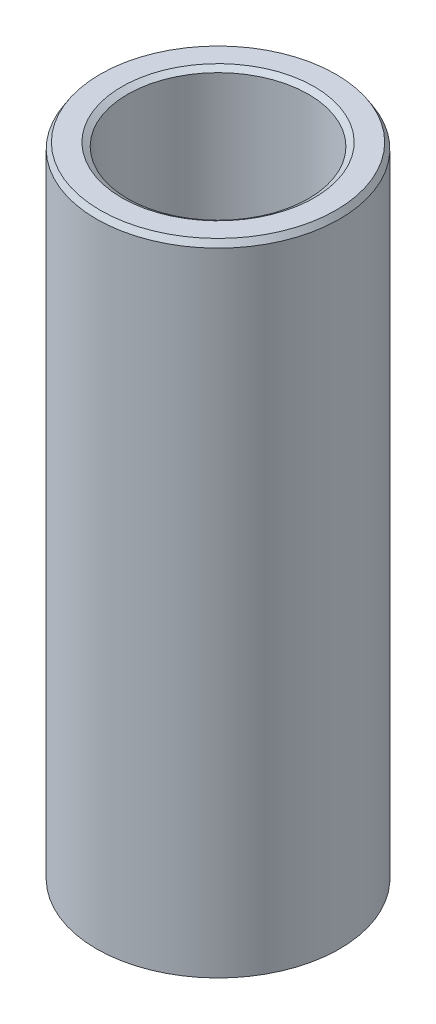
ISO-10303-21;
HEADER;
FILE_DESCRIPTION(('STEP AP214'),'2;1');
FILE_NAME('part.step','',(''),(''),'','','');
FILE_SCHEMA(('AUTOMOTIVE_DESIGN { 1 0 10303 214 1 1 1 1 }'));
ENDSEC;
DATA;
#1=APPLICATION_CONTEXT('core data for automotive mechanical design processes');
#2=APPLICATION_PROTOCOL_DEFINITION('international standard','automotive_design',2000,#1);
#3=PRODUCT_CONTEXT('',#1,'mechanical');
#4=PRODUCT('Part','Part','',(#3));
#5=PRODUCT_RELATED_PRODUCT_CATEGORY('part','',(#4));
#6=PRODUCT_DEFINITION_FORMATION('','',#4);
#7=PRODUCT_DEFINITION_CONTEXT('part definition',#1,'design');
#8=PRODUCT_DEFINITION('design','',#6,#7);
#9=PRODUCT_DEFINITION_SHAPE('','',#8);
#10=(LENGTH_UNIT() NAMED_UNIT(*) SI_UNIT(.MILLI.,.METRE.));
#11=(NAMED_UNIT(*) PLANE_ANGLE_UNIT() SI_UNIT($,.RADIAN.));
#12=(NAMED_UNIT(*) SI_UNIT($,.STERADIAN.) SOLID_ANGLE_UNIT());
#13=UNCERTAINTY_MEASURE_WITH_UNIT(LENGTH_MEASURE(1.E-05),#10,'distance_accuracy_value','');
#14=(GEOMETRIC_REPRESENTATION_CONTEXT(3) GLOBAL_UNCERTAINTY_ASSIGNED_CONTEXT((#13)) GLOBAL_UNIT_ASSIGNED_CONTEXT((#10,
#11,#12)) REPRESENTATION_CONTEXT('',''));
#15=CARTESIAN_POINT('',(0.,0.,0.));
#16=DIRECTION('',(0.,0.,1.));
#17=DIRECTION('',(1.,0.,0.));
#18=AXIS2_PLACEMENT_3D('',#15,#16,#17);
#19=CARTESIAN_POINT('',(0.,118.789899173376,0.));
#20=DIRECTION('',(0.,-1.,0.));
#21=DIRECTION('',(0.,0.,-1.));
#22=AXIS2_PLACEMENT_3D('',#19,#20,#21);
#23=CYLINDRICAL_SURFACE('',#22,22.5);
#24=CARTESIAN_POINT('',(0.,0.678954499826759,0.));
#25=DIRECTION('',(0.,1.,0.));
#26=DIRECTION('',(0.,0.,1.));
#27=AXIS2_PLACEMENT_3D('',#24,#25,#26);
#28=CIRCLE('',#27,22.5);
#29=CARTESIAN_POINT('',(0.,0.678954499826759,22.5));
#30=VERTEX_POINT('',#29);
#31=EDGE_CURVE('E10',#30,#30,#28,.T.);
#32=ORIENTED_EDGE('',*,*,#31,.T.);
#33=EDGE_LOOP('',(#32));
#34=FACE_BOUND('',#33,.T.);
#35=CARTESIAN_POINT('',(0.,117.709709744718,0.));
#36=DIRECTION('',(0.,1.,0.));
#37=DIRECTION('',(0.,0.,1.));
#38=AXIS2_PLACEMENT_3D('',#35,#36,#37);
#39=CIRCLE('',#38,22.5);
#40=CARTESIAN_POINT('',(0.,117.709709744718,22.5));
#41=VERTEX_POINT('',#40);
#42=EDGE_CURVE('E50',#41,#41,#39,.F.);
#43=ORIENTED_EDGE('',*,*,#42,.T.);
#44=EDGE_LOOP('',(#43));
#45=FACE_BOUND('',#44,.T.);
#46=ADVANCED_FACE('F39',(#34,#45),#23,.T.);
#47=CARTESIAN_POINT('',(0.,118.789899173376,0.));
#48=DIRECTION('',(0.,1.,0.));
#49=DIRECTION('',(0.,0.,1.));
#50=AXIS2_PLACEMENT_3D('',#47,#48,#49);
#51=PLANE('',#50);
#52=CARTESIAN_POINT('',(0.,118.789899173376,0.));
#53=DIRECTION('',(0.,1.,0.));
#54=DIRECTION('',(0.,0.,1.));
#55=AXIS2_PLACEMENT_3D('',#52,#53,#54);
#56=CIRCLE('',#55,17.8252690168274);
#57=CARTESIAN_POINT('',(0.,118.789899173376,17.8252690168274));
#58=VERTEX_POINT('',#57);
#59=EDGE_CURVE('E58',#58,#58,#56,.F.);
#60=ORIENTED_EDGE('',*,*,#59,.T.);
#61=EDGE_LOOP('',(#60));
#62=FACE_BOUND('',#61,.T.);
#63=CARTESIAN_POINT('',(0.,118.789899173376,0.));
#64=DIRECTION('',(0.,1.,0.));
#65=DIRECTION('',(0.,0.,1.));
#66=AXIS2_PLACEMENT_3D('',#63,#64,#65);
#67=CIRCLE('',#66,21.8210455001733);
#68=CARTESIAN_POINT('',(0.,118.789899173376,21.8210455001733));
#69=VERTEX_POINT('',#68);
#70=EDGE_CURVE('E61',#69,#69,#67,.T.);
#71=ORIENTED_EDGE('',*,*,#70,.T.);
#72=EDGE_LOOP('',(#71));
#73=FACE_BOUND('',#72,.T.);
#74=ADVANCED_FACE('F88',(#62,#73),#51,.T.);
#75=CARTESIAN_POINT('',(0.,0.,0.));
#76=DIRECTION('',(0.,1.,0.));
#77=DIRECTION('',(0.,0.,1.));
#78=AXIS2_PLACEMENT_3D('',#75,#76,#77);
#79=PLANE('',#78);
#80=CARTESIAN_POINT('',(0.,0.,0.));
#81=DIRECTION('',(0.,1.,0.));
#82=DIRECTION('',(0.,0.,1.));
#83=AXIS2_PLACEMENT_3D('',#80,#81,#82);
#84=CIRCLE('',#83,17.424034087997);
#85=CARTESIAN_POINT('',(0.,0.,17.424034087997));
#86=VERTEX_POINT('',#85);
#87=EDGE_CURVE('E51',#86,#86,#84,.T.);
#88=ORIENTED_EDGE('',*,*,#87,.T.);
#89=EDGE_LOOP('',(#88));
#90=FACE_BOUND('',#89,.T.);
#91=CARTESIAN_POINT('',(0.,0.,0.));
#92=DIRECTION('',(0.,1.,0.));
#93=DIRECTION('',(0.,0.,1.));
#94=AXIS2_PLACEMENT_3D('',#91,#92,#93);
#95=CIRCLE('',#94,21.4198105713428);
#96=CARTESIAN_POINT('',(0.,0.,21.4198105713428));
#97=VERTEX_POINT('',#96);
#98=EDGE_CURVE('E54',#97,#97,#95,.F.);
#99=ORIENTED_EDGE('',*,*,#98,.T.);
#100=EDGE_LOOP('',(#99));
#101=FACE_BOUND('',#100,.T.);
#102=ADVANCED_FACE('F83',(#90,#101),#79,.F.);
#103=CARTESIAN_POINT('',(0.,118.789899173376,0.));
#104=DIRECTION('',(0.,-1.,0.));
#105=DIRECTION('',(0.,0.,-1.));
#106=AXIS2_PLACEMENT_3D('',#103,#104,#105);
#107=CYLINDRICAL_SURFACE('',#106,16.7450795881702);
#108=CARTESIAN_POINT('',(0.,118.110944673549,0.));
#109=DIRECTION('',(0.,1.,0.));
#110=DIRECTION('',(0.,0.,1.));
#111=AXIS2_PLACEMENT_3D('',#108,#109,#110);
#112=CIRCLE('',#111,16.7450795881702);
#113=CARTESIAN_POINT('',(0.,118.110944673549,16.7450795881702));
#114=VERTEX_POINT('',#113);
#115=EDGE_CURVE('E67',#114,#114,#112,.T.);
#116=ORIENTED_EDGE('',*,*,#115,.T.);
#117=EDGE_LOOP('',(#116));
#118=FACE_BOUND('',#117,.T.);
#119=CARTESIAN_POINT('',(0.,1.0801894286572,0.));
#120=DIRECTION('',(0.,1.,0.));
#121=DIRECTION('',(0.,0.,1.));
#122=AXIS2_PLACEMENT_3D('',#119,#120,#121);
#123=CIRCLE('',#122,16.7450795881702);
#124=CARTESIAN_POINT('',(0.,1.0801894286572,16.7450795881702));
#125=VERTEX_POINT('',#124);
#126=EDGE_CURVE('E69',#125,#125,#123,.F.);
#127=ORIENTED_EDGE('',*,*,#126,.T.);
#128=EDGE_LOOP('',(#127));
#129=FACE_BOUND('',#128,.T.);
#130=ADVANCED_FACE('F71',(#118,#129),#107,.F.);
#131=CARTESIAN_POINT('',(0.,118.110944673549,0.));
#132=DIRECTION('',(0.,1.,0.));
#133=DIRECTION('',(0.,0.,1.));
#134=AXIS2_PLACEMENT_3D('',#131,#132,#133);
#135=CONICAL_SURFACE('',#134,16.7450795881702,1.00964732262628);
#136=ORIENTED_EDGE('',*,*,#59,.F.);
#137=EDGE_LOOP('',(#136));
#138=FACE_BOUND('',#137,.T.);
#139=ORIENTED_EDGE('',*,*,#115,.F.);
#140=EDGE_LOOP('',(#139));
#141=FACE_BOUND('',#140,.T.);
#142=ADVANCED_FACE('F77',(#138,#141),#135,.F.);
#143=CARTESIAN_POINT('',(0.,0.,0.));
#144=DIRECTION('',(0.,-1.,0.));
#145=DIRECTION('',(0.,0.,-1.));
#146=AXIS2_PLACEMENT_3D('',#143,#144,#145);
#147=CONICAL_SURFACE('',#146,17.424034087997,0.561149004168625);
#148=ORIENTED_EDGE('',*,*,#126,.F.);
#149=EDGE_LOOP('',(#148));
#150=FACE_BOUND('',#149,.T.);
#151=ORIENTED_EDGE('',*,*,#87,.F.);
#152=EDGE_LOOP('',(#151));
#153=FACE_BOUND('',#152,.T.);
#154=ADVANCED_FACE('F73',(#150,#153),#147,.F.);
#155=CARTESIAN_POINT('',(0.,0.678954499826759,0.));
#156=DIRECTION('',(0.,1.,0.));
#157=DIRECTION('',(0.,0.,1.));
#158=AXIS2_PLACEMENT_3D('',#155,#156,#157);
#159=CONICAL_SURFACE('',#158,22.5,1.00964732262628);
#160=ORIENTED_EDGE('',*,*,#98,.F.);
#161=EDGE_LOOP('',(#160));
#162=FACE_BOUND('',#161,.T.);
#163=ORIENTED_EDGE('',*,*,#31,.F.);
#164=EDGE_LOOP('',(#163));
#165=FACE_BOUND('',#164,.T.);
#166=ADVANCED_FACE('F76',(#162,#165),#159,.T.);
#167=CARTESIAN_POINT('',(0.,118.789899173376,0.));
#168=DIRECTION('',(0.,-1.,0.));
#169=DIRECTION('',(0.,0.,-1.));
#170=AXIS2_PLACEMENT_3D('',#167,#168,#169);
#171=CONICAL_SURFACE('',#170,21.8210455001733,0.561149004168624);
#172=ORIENTED_EDGE('',*,*,#42,.F.);
#173=EDGE_LOOP('',(#172));
#174=FACE_BOUND('',#173,.T.);
#175=ORIENTED_EDGE('',*,*,#70,.F.);
#176=EDGE_LOOP('',(#175));
#177=FACE_BOUND('',#176,.T.);
#178=ADVANCED_FACE('F45',(#174,#177),#171,.T.);
#179=CLOSED_SHELL('',(#46,#74,#102,#130,#142,#154,#166,#178));
#180=MANIFOLD_SOLID_BREP('B2',#179);
#181=ADVANCED_BREP_SHAPE_REPRESENTATION('',(#18,#180),#14);
#182=SHAPE_DEFINITION_REPRESENTATION(#9,#181);
ENDSEC;
END-ISO-10303-21;
